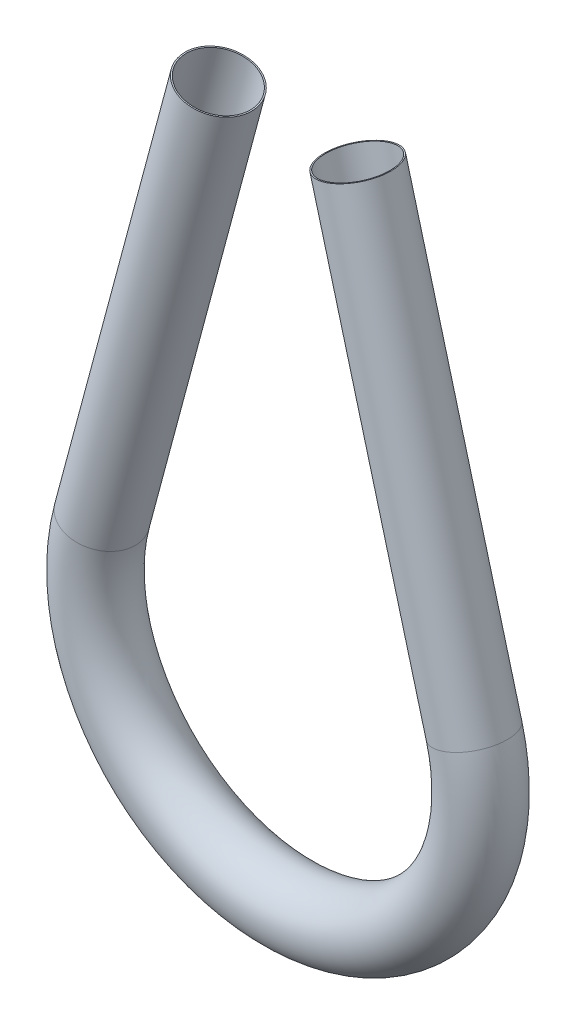
ISO-10303-21;
HEADER;
FILE_DESCRIPTION(('STEP AP214'),'2;1');
FILE_NAME('part.step','',(''),(''),'','','');
FILE_SCHEMA(('AUTOMOTIVE_DESIGN { 1 0 10303 214 1 1 1 1 }'));
ENDSEC;
DATA;
#1=APPLICATION_CONTEXT('core data for automotive mechanical design processes');
#2=APPLICATION_PROTOCOL_DEFINITION('international standard','automotive_design',2000,#1);
#3=PRODUCT_CONTEXT('',#1,'mechanical');
#4=PRODUCT('Part','Part','',(#3));
#5=PRODUCT_RELATED_PRODUCT_CATEGORY('part','',(#4));
#6=PRODUCT_DEFINITION_FORMATION('','',#4);
#7=PRODUCT_DEFINITION_CONTEXT('part definition',#1,'design');
#8=PRODUCT_DEFINITION('design','',#6,#7);
#9=PRODUCT_DEFINITION_SHAPE('','',#8);
#10=(LENGTH_UNIT() NAMED_UNIT(*) SI_UNIT(.MILLI.,.METRE.));
#11=(NAMED_UNIT(*) PLANE_ANGLE_UNIT() SI_UNIT($,.RADIAN.));
#12=(NAMED_UNIT(*) SI_UNIT($,.STERADIAN.) SOLID_ANGLE_UNIT());
#13=UNCERTAINTY_MEASURE_WITH_UNIT(LENGTH_MEASURE(1.E-05),#10,'distance_accuracy_value','');
#14=(GEOMETRIC_REPRESENTATION_CONTEXT(3) GLOBAL_UNCERTAINTY_ASSIGNED_CONTEXT((#13)) GLOBAL_UNIT_ASSIGNED_CONTEXT((#10,
#11,#12)) REPRESENTATION_CONTEXT('',''));
#15=CARTESIAN_POINT('',(0.,0.,0.));
#16=DIRECTION('',(0.,0.,1.));
#17=DIRECTION('',(1.,0.,0.));
#18=AXIS2_PLACEMENT_3D('',#15,#16,#17);
#19=CARTESIAN_POINT('',(-110.667274095581,-9.29628851650563,-4.71844785465692E-13));
#20=DIRECTION('',(0.258819045102515,-0.96592582628907,0.));
#21=DIRECTION('',(0.965925826289072,0.258819045102515,0.));
#22=AXIS2_PLACEMENT_3D('',#19,#20,#21);
#23=CYLINDRICAL_SURFACE('',#22,6.604);
#24=CARTESIAN_POINT('',(-88.3899767612724,-92.4362940234648,0.));
#25=DIRECTION('',(0.258819045102514,-0.96592582628907,0.));
#26=DIRECTION('',(0.965925826289072,0.258819045102514,0.));
#27=AXIS2_PLACEMENT_3D('',#24,#25,#26);
#28=CIRCLE('',#27,6.604);
#29=CARTESIAN_POINT('',(-82.0110026044597,-90.7270530496079,0.));
#30=VERTEX_POINT('',#29);
#31=EDGE_CURVE('E78',#30,#30,#28,.T.);
#32=ORIENTED_EDGE('',*,*,#31,.F.);
#33=EDGE_LOOP('',(#32));
#34=FACE_BOUND('',#33,.T.);
#35=CARTESIAN_POINT('',(-110.667274095581,-9.29628851650563,-4.71844785465692E-13));
#36=DIRECTION('',(0.258819045102514,-0.96592582628907,0.));
#37=DIRECTION('',(0.965925826289072,0.258819045102514,0.));
#38=AXIS2_PLACEMENT_3D('',#35,#36,#37);
#39=CIRCLE('',#38,6.604);
#40=CARTESIAN_POINT('',(-104.288299938768,-7.58704754264883,-2.22044604925031E-13));
#41=VERTEX_POINT('',#40);
#42=EDGE_CURVE('E47',#41,#41,#39,.T.);
#43=ORIENTED_EDGE('',*,*,#42,.T.);
#44=EDGE_LOOP('',(#43));
#45=FACE_BOUND('',#44,.T.);
#46=ADVANCED_FACE('F32',(#34,#45),#23,.T.);
#47=CARTESIAN_POINT('',(-124.004465969192,-101.979167645573,-4.44089209850063E-13));
#48=DIRECTION('',(0.,0.,-1.));
#49=DIRECTION('',(-1.,0.,0.));
#50=AXIS2_PLACEMENT_3D('',#47,#48,#49);
#51=TOROIDAL_SURFACE('',#50,36.870832354431,6.604);
#52=CARTESIAN_POINT('',(-159.618955177111,-92.4362940234649,-1.94289029309402E-13));
#53=DIRECTION('',(0.258819045102515,0.965925826289072,0.));
#54=DIRECTION('',(-0.965925826289068,0.258819045102516,0.));
#55=AXIS2_PLACEMENT_3D('',#52,#53,#54);
#56=CIRCLE('',#55,6.604);
#57=CARTESIAN_POINT('',(-165.997929333925,-90.7270530496078,-1.49546877127086E-13));
#58=VERTEX_POINT('',#57);
#59=EDGE_CURVE('E36',#58,#58,#56,.T.);
#60=CARTESIAN_POINT('',(-124.004465969192,-101.979167645573,-4.44089209850063E-13));
#61=DIRECTION('',(0.,0.,-1.));
#62=DIRECTION('',(-1.,0.,0.));
#63=AXIS2_PLACEMENT_3D('',#60,#61,#62);
#64=CIRCLE('',#63,43.474832354431);
#65=EDGE_CURVE('',#30,#58,#64,.T.);
#66=ORIENTED_EDGE('',*,*,#31,.T.);
#67=ORIENTED_EDGE('',*,*,#59,.F.);
#68=ORIENTED_EDGE('',*,*,#65,.T.);
#69=ORIENTED_EDGE('',*,*,#65,.F.);
#70=EDGE_LOOP('',(#66,#68,#67,#69));
#71=FACE_BOUND('',#70,.T.);
#72=ADVANCED_FACE('F86',(#71),#51,.T.);
#73=CARTESIAN_POINT('',(-159.618955177111,-92.4362940234649,-1.94289029309402E-13));
#74=DIRECTION('',(0.258819045102496,0.965925826289077,0.));
#75=DIRECTION('',(-0.965925826289073,0.258819045102496,0.));
#76=AXIS2_PLACEMENT_3D('',#73,#74,#75);
#77=CYLINDRICAL_SURFACE('',#76,6.604);
#78=CARTESIAN_POINT('',(-137.341657842805,-9.29628851650594,-4.9960036108132E-13));
#79=DIRECTION('',(0.258819045102496,0.965925826289079,0.));
#80=DIRECTION('',(-0.965925826289073,0.258819045102496,0.));
#81=AXIS2_PLACEMENT_3D('',#78,#79,#80);
#82=CIRCLE('',#81,6.604);
#83=CARTESIAN_POINT('',(-143.720631999618,-7.58704754264858,-1.66533453693773E-13));
#84=VERTEX_POINT('',#83);
#85=EDGE_CURVE('E52',#84,#84,#82,.T.);
#86=ORIENTED_EDGE('',*,*,#85,.F.);
#87=EDGE_LOOP('',(#86));
#88=FACE_BOUND('',#87,.T.);
#89=ORIENTED_EDGE('',*,*,#59,.T.);
#90=EDGE_LOOP('',(#89));
#91=FACE_BOUND('',#90,.T.);
#92=ADVANCED_FACE('F34',(#88,#91),#77,.T.);
#93=CARTESIAN_POINT('',(-110.667274095581,-9.29628851650563,-4.71844785465692E-13));
#94=DIRECTION('',(0.258819045102514,-0.96592582628907,0.));
#95=DIRECTION('',(0.965925826289072,0.258819045102514,0.));
#96=AXIS2_PLACEMENT_3D('',#93,#94,#95);
#97=PLANE('',#96);
#98=CARTESIAN_POINT('',(-110.667274095581,-9.29628851650563,-4.71844785465692E-13));
#99=DIRECTION('',(0.258819045102514,-0.96592582628907,0.));
#100=DIRECTION('',(0.965925826289072,0.258819045102514,0.));
#101=AXIS2_PLACEMENT_3D('',#98,#99,#100);
#102=CIRCLE('',#101,6.35);
#103=CARTESIAN_POINT('',(-104.533645098645,-7.65278758010468,0.));
#104=VERTEX_POINT('',#103);
#105=EDGE_CURVE('E73',#104,#104,#102,.F.);
#106=ORIENTED_EDGE('',*,*,#105,.F.);
#107=EDGE_LOOP('',(#106));
#108=FACE_BOUND('',#107,.T.);
#109=ORIENTED_EDGE('',*,*,#42,.F.);
#110=EDGE_LOOP('',(#109));
#111=FACE_BOUND('',#110,.T.);
#112=ADVANCED_FACE('F92',(#108,#111),#97,.F.);
#113=CARTESIAN_POINT('',(-137.341657842805,-9.29628851650594,-4.9960036108132E-13));
#114=DIRECTION('',(0.258819045102496,0.965925826289079,0.));
#115=DIRECTION('',(-0.965925826289073,0.258819045102496,0.));
#116=AXIS2_PLACEMENT_3D('',#113,#114,#115);
#117=PLANE('',#116);
#118=CARTESIAN_POINT('',(-137.341657842805,-9.29628851650594,-4.9960036108132E-13));
#119=DIRECTION('',(0.258819045102496,0.965925826289079,0.));
#120=DIRECTION('',(-0.965925826289073,0.258819045102496,0.));
#121=AXIS2_PLACEMENT_3D('',#118,#119,#120);
#122=CIRCLE('',#121,6.35);
#123=CARTESIAN_POINT('',(-143.475286839741,-7.65278758010443,-3.33066907387547E-13));
#124=VERTEX_POINT('',#123);
#125=EDGE_CURVE('E11',#124,#124,#122,.F.);
#126=ORIENTED_EDGE('',*,*,#125,.T.);
#127=EDGE_LOOP('',(#126));
#128=FACE_BOUND('',#127,.T.);
#129=ORIENTED_EDGE('',*,*,#85,.T.);
#130=EDGE_LOOP('',(#129));
#131=FACE_BOUND('',#130,.T.);
#132=ADVANCED_FACE('F59',(#128,#131),#117,.T.);
#133=CARTESIAN_POINT('',(-110.667274095581,-9.29628851650563,-4.71844785465692E-13));
#134=DIRECTION('',(0.258819045102515,-0.96592582628907,0.));
#135=DIRECTION('',(0.965925826289072,0.258819045102515,0.));
#136=AXIS2_PLACEMENT_3D('',#133,#134,#135);
#137=CYLINDRICAL_SURFACE('',#136,6.35);
#138=CARTESIAN_POINT('',(-88.3899767612724,-92.4362940234648,0.));
#139=DIRECTION('',(0.258819045102514,-0.96592582628907,0.));
#140=DIRECTION('',(0.965925826289072,0.258819045102514,0.));
#141=AXIS2_PLACEMENT_3D('',#138,#139,#140);
#142=CIRCLE('',#141,6.35);
#143=CARTESIAN_POINT('',(-82.2563477643371,-90.7927930870639,0.));
#144=VERTEX_POINT('',#143);
#145=EDGE_CURVE('E70',#144,#144,#142,.F.);
#146=ORIENTED_EDGE('',*,*,#145,.F.);
#147=EDGE_LOOP('',(#146));
#148=FACE_BOUND('',#147,.T.);
#149=ORIENTED_EDGE('',*,*,#105,.T.);
#150=EDGE_LOOP('',(#149));
#151=FACE_BOUND('',#150,.T.);
#152=ADVANCED_FACE('F100',(#148,#151),#137,.F.);
#153=CARTESIAN_POINT('',(-124.004465969192,-101.979167645573,-4.44089209850063E-13));
#154=DIRECTION('',(0.,0.,-1.));
#155=DIRECTION('',(-1.,0.,0.));
#156=AXIS2_PLACEMENT_3D('',#153,#154,#155);
#157=TOROIDAL_SURFACE('',#156,36.870832354431,6.35);
#158=CARTESIAN_POINT('',(-159.618955177111,-92.4362940234649,-1.94289029309402E-13));
#159=DIRECTION('',(0.258819045102515,0.965925826289072,0.));
#160=DIRECTION('',(-0.965925826289068,0.258819045102516,0.));
#161=AXIS2_PLACEMENT_3D('',#158,#159,#160);
#162=CIRCLE('',#161,6.35);
#163=CARTESIAN_POINT('',(-165.752584174047,-90.7927930870638,-1.51267729134098E-13));
#164=VERTEX_POINT('',#163);
#165=EDGE_CURVE('E41',#164,#164,#162,.F.);
#166=CARTESIAN_POINT('',(-124.004465969192,-101.979167645573,-4.44089209850063E-13));
#167=DIRECTION('',(0.,0.,-1.));
#168=DIRECTION('',(-1.,0.,0.));
#169=AXIS2_PLACEMENT_3D('',#166,#167,#168);
#170=CIRCLE('',#169,43.220832354431);
#171=EDGE_CURVE('',#144,#164,#170,.T.);
#172=ORIENTED_EDGE('',*,*,#145,.T.);
#173=ORIENTED_EDGE('',*,*,#165,.F.);
#174=ORIENTED_EDGE('',*,*,#171,.T.);
#175=ORIENTED_EDGE('',*,*,#171,.F.);
#176=EDGE_LOOP('',(#172,#174,#173,#175));
#177=FACE_BOUND('',#176,.T.);
#178=ADVANCED_FACE('F65',(#177),#157,.F.);
#179=CARTESIAN_POINT('',(-159.618955177111,-92.4362940234649,-1.94289029309402E-13));
#180=DIRECTION('',(0.258819045102496,0.965925826289077,0.));
#181=DIRECTION('',(-0.965925826289073,0.258819045102496,0.));
#182=AXIS2_PLACEMENT_3D('',#179,#180,#181);
#183=CYLINDRICAL_SURFACE('',#182,6.35);
#184=ORIENTED_EDGE('',*,*,#125,.F.);
#185=EDGE_LOOP('',(#184));
#186=FACE_BOUND('',#185,.T.);
#187=ORIENTED_EDGE('',*,*,#165,.T.);
#188=EDGE_LOOP('',(#187));
#189=FACE_BOUND('',#188,.T.);
#190=ADVANCED_FACE('F62',(#186,#189),#183,.F.);
#191=CLOSED_SHELL('',(#46,#72,#92,#112,#132,#152,#178,#190));
#192=MANIFOLD_SOLID_BREP('B2',#191);
#193=ADVANCED_BREP_SHAPE_REPRESENTATION('',(#18,#192),#14);
#194=SHAPE_DEFINITION_REPRESENTATION(#9,#193);
ENDSEC;
END-ISO-10303-21;
